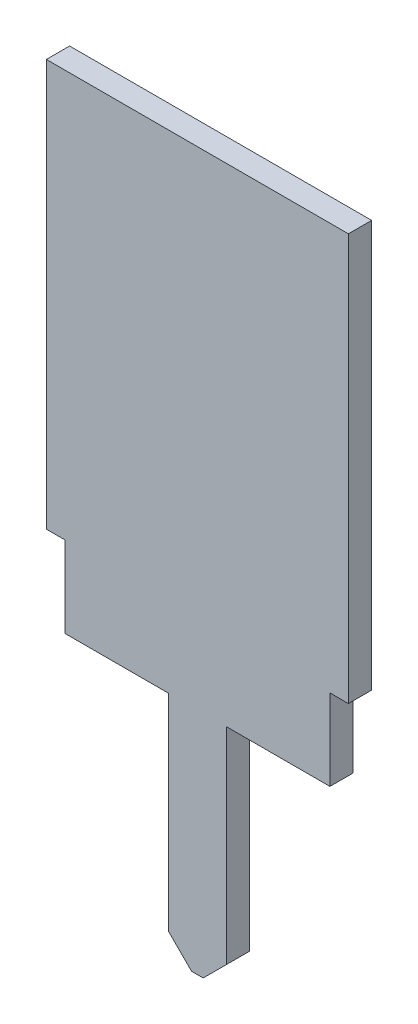
ISO-10303-21;
HEADER;
FILE_DESCRIPTION(('STEP AP214'),'2;1');
FILE_NAME('part.step','',(''),(''),'','','');
FILE_SCHEMA(('AUTOMOTIVE_DESIGN { 1 0 10303 214 1 1 1 1 }'));
ENDSEC;
DATA;
#1=APPLICATION_CONTEXT('core data for automotive mechanical design processes');
#2=APPLICATION_PROTOCOL_DEFINITION('international standard','automotive_design',2000,#1);
#3=PRODUCT_CONTEXT('',#1,'mechanical');
#4=PRODUCT('Part','Part','',(#3));
#5=PRODUCT_RELATED_PRODUCT_CATEGORY('part','',(#4));
#6=PRODUCT_DEFINITION_FORMATION('','',#4);
#7=PRODUCT_DEFINITION_CONTEXT('part definition',#1,'design');
#8=PRODUCT_DEFINITION('design','',#6,#7);
#9=PRODUCT_DEFINITION_SHAPE('','',#8);
#10=(LENGTH_UNIT() NAMED_UNIT(*) SI_UNIT(.MILLI.,.METRE.));
#11=(NAMED_UNIT(*) PLANE_ANGLE_UNIT() SI_UNIT($,.RADIAN.));
#12=(NAMED_UNIT(*) SI_UNIT($,.STERADIAN.) SOLID_ANGLE_UNIT());
#13=UNCERTAINTY_MEASURE_WITH_UNIT(LENGTH_MEASURE(1.E-05),#10,'distance_accuracy_value','');
#14=(GEOMETRIC_REPRESENTATION_CONTEXT(3) GLOBAL_UNCERTAINTY_ASSIGNED_CONTEXT((#13)) GLOBAL_UNIT_ASSIGNED_CONTEXT((#10,
#11,#12)) REPRESENTATION_CONTEXT('',''));
#15=CARTESIAN_POINT('',(0.,0.,0.));
#16=DIRECTION('',(0.,0.,1.));
#17=DIRECTION('',(1.,0.,0.));
#18=AXIS2_PLACEMENT_3D('',#15,#16,#17);
#19=CARTESIAN_POINT('',(1.65,0.,0.127));
#20=DIRECTION('',(0.,-1.,0.));
#21=DIRECTION('',(0.,0.,-1.));
#22=AXIS2_PLACEMENT_3D('',#19,#20,#21);
#23=PLANE('',#22);
#24=DIRECTION('',(-1.,0.,0.));
#25=VECTOR('',#24,1.);
#26=CARTESIAN_POINT('',(1.65,0.,-0.127));
#27=LINE('',#26,#25);
#28=CARTESIAN_POINT('',(1.65,0.,-0.127));
#29=VERTEX_POINT('',#28);
#30=CARTESIAN_POINT('',(-1.65,0.,-0.127));
#31=VERTEX_POINT('',#30);
#32=EDGE_CURVE('E10',#29,#31,#27,.T.);
#33=ORIENTED_EDGE('',*,*,#32,.T.);
#34=DIRECTION('',(0.,0.,-1.));
#35=VECTOR('',#34,1.);
#36=CARTESIAN_POINT('',(-1.65,0.,0.127));
#37=LINE('',#36,#35);
#38=CARTESIAN_POINT('',(-1.65,0.,0.127));
#39=VERTEX_POINT('',#38);
#40=EDGE_CURVE('E24',#39,#31,#37,.T.);
#41=ORIENTED_EDGE('',*,*,#40,.F.);
#42=DIRECTION('',(-1.,0.,0.));
#43=VECTOR('',#42,1.);
#44=CARTESIAN_POINT('',(1.65,0.,0.127));
#45=LINE('',#44,#43);
#46=CARTESIAN_POINT('',(1.65,0.,0.127));
#47=VERTEX_POINT('',#46);
#48=EDGE_CURVE('E295',#47,#39,#45,.T.);
#49=ORIENTED_EDGE('',*,*,#48,.F.);
#50=DIRECTION('',(0.,0.,-1.));
#51=VECTOR('',#50,1.);
#52=CARTESIAN_POINT('',(1.65,0.,0.127));
#53=LINE('',#52,#51);
#54=EDGE_CURVE('E291',#47,#29,#53,.T.);
#55=ORIENTED_EDGE('',*,*,#54,.T.);
#56=EDGE_LOOP('',(#33,#41,#49,#55));
#57=FACE_BOUND('',#56,.T.);
#58=ADVANCED_FACE('F16',(#57),#23,.F.);
#59=CARTESIAN_POINT('',(1.65,-4.445,0.127));
#60=DIRECTION('',(-1.,0.,0.));
#61=DIRECTION('',(0.,0.,1.));
#62=AXIS2_PLACEMENT_3D('',#59,#60,#61);
#63=PLANE('',#62);
#64=DIRECTION('',(0.,1.,0.));
#65=VECTOR('',#64,1.);
#66=CARTESIAN_POINT('',(1.65,-4.445,-0.127));
#67=LINE('',#66,#65);
#68=CARTESIAN_POINT('',(1.65,-4.445,-0.127));
#69=VERTEX_POINT('',#68);
#70=EDGE_CURVE('E286',#69,#29,#67,.T.);
#71=ORIENTED_EDGE('',*,*,#70,.T.);
#72=ORIENTED_EDGE('',*,*,#54,.F.);
#73=DIRECTION('',(0.,1.,0.));
#74=VECTOR('',#73,1.);
#75=CARTESIAN_POINT('',(1.65,-4.445,0.127));
#76=LINE('',#75,#74);
#77=CARTESIAN_POINT('',(1.65,-4.445,0.127));
#78=VERTEX_POINT('',#77);
#79=EDGE_CURVE('E281',#78,#47,#76,.T.);
#80=ORIENTED_EDGE('',*,*,#79,.F.);
#81=DIRECTION('',(0.,0.,-1.));
#82=VECTOR('',#81,1.);
#83=CARTESIAN_POINT('',(1.65,-4.445,0.127));
#84=LINE('',#83,#82);
#85=EDGE_CURVE('E277',#78,#69,#84,.T.);
#86=ORIENTED_EDGE('',*,*,#85,.T.);
#87=EDGE_LOOP('',(#71,#72,#80,#86));
#88=FACE_BOUND('',#87,.T.);
#89=ADVANCED_FACE('F308',(#88),#63,.F.);
#90=CARTESIAN_POINT('',(1.448,-4.445,0.127));
#91=DIRECTION('',(0.,1.,0.));
#92=DIRECTION('',(0.,0.,1.));
#93=AXIS2_PLACEMENT_3D('',#90,#91,#92);
#94=PLANE('',#93);
#95=DIRECTION('',(1.,0.,0.));
#96=VECTOR('',#95,1.);
#97=CARTESIAN_POINT('',(1.448,-4.445,-0.127));
#98=LINE('',#97,#96);
#99=CARTESIAN_POINT('',(1.448,-4.445,-0.127));
#100=VERTEX_POINT('',#99);
#101=EDGE_CURVE('E272',#100,#69,#98,.T.);
#102=ORIENTED_EDGE('',*,*,#101,.T.);
#103=ORIENTED_EDGE('',*,*,#85,.F.);
#104=DIRECTION('',(1.,0.,0.));
#105=VECTOR('',#104,1.);
#106=CARTESIAN_POINT('',(1.448,-4.445,0.127));
#107=LINE('',#106,#105);
#108=CARTESIAN_POINT('',(1.448,-4.445,0.127));
#109=VERTEX_POINT('',#108);
#110=EDGE_CURVE('E267',#109,#78,#107,.T.);
#111=ORIENTED_EDGE('',*,*,#110,.F.);
#112=DIRECTION('',(0.,0.,-1.));
#113=VECTOR('',#112,1.);
#114=CARTESIAN_POINT('',(1.448,-4.445,0.127));
#115=LINE('',#114,#113);
#116=EDGE_CURVE('E263',#109,#100,#115,.T.);
#117=ORIENTED_EDGE('',*,*,#116,.T.);
#118=EDGE_LOOP('',(#102,#103,#111,#117));
#119=FACE_BOUND('',#118,.T.);
#120=ADVANCED_FACE('F315',(#119),#94,.F.);
#121=CARTESIAN_POINT('',(1.448,-5.33,0.127));
#122=DIRECTION('',(-1.,0.,0.));
#123=DIRECTION('',(0.,0.,1.));
#124=AXIS2_PLACEMENT_3D('',#121,#122,#123);
#125=PLANE('',#124);
#126=DIRECTION('',(0.,1.,0.));
#127=VECTOR('',#126,1.);
#128=CARTESIAN_POINT('',(1.448,-5.33,-0.127));
#129=LINE('',#128,#127);
#130=CARTESIAN_POINT('',(1.448,-5.33,-0.127));
#131=VERTEX_POINT('',#130);
#132=EDGE_CURVE('E258',#131,#100,#129,.T.);
#133=ORIENTED_EDGE('',*,*,#132,.T.);
#134=ORIENTED_EDGE('',*,*,#116,.F.);
#135=DIRECTION('',(0.,1.,0.));
#136=VECTOR('',#135,1.);
#137=CARTESIAN_POINT('',(1.448,-5.33,0.127));
#138=LINE('',#137,#136);
#139=CARTESIAN_POINT('',(1.448,-5.33,0.127));
#140=VERTEX_POINT('',#139);
#141=EDGE_CURVE('E253',#140,#109,#138,.T.);
#142=ORIENTED_EDGE('',*,*,#141,.F.);
#143=DIRECTION('',(0.,0.,-1.));
#144=VECTOR('',#143,1.);
#145=CARTESIAN_POINT('',(1.448,-5.33,0.127));
#146=LINE('',#145,#144);
#147=EDGE_CURVE('E249',#140,#131,#146,.T.);
#148=ORIENTED_EDGE('',*,*,#147,.T.);
#149=EDGE_LOOP('',(#133,#134,#142,#148));
#150=FACE_BOUND('',#149,.T.);
#151=ADVANCED_FACE('F318',(#150),#125,.F.);
#152=CARTESIAN_POINT('',(0.3175,-5.33,0.127));
#153=DIRECTION('',(0.,1.,0.));
#154=DIRECTION('',(0.,0.,1.));
#155=AXIS2_PLACEMENT_3D('',#152,#153,#154);
#156=PLANE('',#155);
#157=DIRECTION('',(1.,0.,0.));
#158=VECTOR('',#157,1.);
#159=CARTESIAN_POINT('',(0.3175,-5.33,-0.127));
#160=LINE('',#159,#158);
#161=CARTESIAN_POINT('',(0.3175,-5.33,-0.127));
#162=VERTEX_POINT('',#161);
#163=EDGE_CURVE('E244',#162,#131,#160,.T.);
#164=ORIENTED_EDGE('',*,*,#163,.T.);
#165=ORIENTED_EDGE('',*,*,#147,.F.);
#166=DIRECTION('',(1.,0.,0.));
#167=VECTOR('',#166,1.);
#168=CARTESIAN_POINT('',(0.3175,-5.33,0.127));
#169=LINE('',#168,#167);
#170=CARTESIAN_POINT('',(0.3175,-5.33,0.127));
#171=VERTEX_POINT('',#170);
#172=EDGE_CURVE('E239',#171,#140,#169,.T.);
#173=ORIENTED_EDGE('',*,*,#172,.F.);
#174=DIRECTION('',(0.,0.,-1.));
#175=VECTOR('',#174,1.);
#176=CARTESIAN_POINT('',(0.3175,-5.33,0.127));
#177=LINE('',#176,#175);
#178=EDGE_CURVE('E235',#171,#162,#177,.T.);
#179=ORIENTED_EDGE('',*,*,#178,.T.);
#180=EDGE_LOOP('',(#164,#165,#173,#179));
#181=FACE_BOUND('',#180,.T.);
#182=ADVANCED_FACE('F321',(#181),#156,.F.);
#183=CARTESIAN_POINT('',(0.3175,-7.581,0.127));
#184=DIRECTION('',(-1.,0.,0.));
#185=DIRECTION('',(0.,0.,1.));
#186=AXIS2_PLACEMENT_3D('',#183,#184,#185);
#187=PLANE('',#186);
#188=DIRECTION('',(0.,1.,0.));
#189=VECTOR('',#188,1.);
#190=CARTESIAN_POINT('',(0.3175,-7.581,-0.127));
#191=LINE('',#190,#189);
#192=CARTESIAN_POINT('',(0.3175,-7.581,-0.127));
#193=VERTEX_POINT('',#192);
#194=EDGE_CURVE('E230',#193,#162,#191,.T.);
#195=ORIENTED_EDGE('',*,*,#194,.T.);
#196=ORIENTED_EDGE('',*,*,#178,.F.);
#197=DIRECTION('',(0.,1.,0.));
#198=VECTOR('',#197,1.);
#199=CARTESIAN_POINT('',(0.3175,-7.581,0.127));
#200=LINE('',#199,#198);
#201=CARTESIAN_POINT('',(0.3175,-7.581,0.127));
#202=VERTEX_POINT('',#201);
#203=EDGE_CURVE('E225',#202,#171,#200,.T.);
#204=ORIENTED_EDGE('',*,*,#203,.F.);
#205=DIRECTION('',(0.,0.,-1.));
#206=VECTOR('',#205,1.);
#207=CARTESIAN_POINT('',(0.3175,-7.581,0.127));
#208=LINE('',#207,#206);
#209=EDGE_CURVE('E221',#202,#193,#208,.T.);
#210=ORIENTED_EDGE('',*,*,#209,.T.);
#211=EDGE_LOOP('',(#195,#196,#204,#210));
#212=FACE_BOUND('',#211,.T.);
#213=ADVANCED_FACE('F327',(#212),#187,.F.);
#214=CARTESIAN_POINT('',(0.0635,-7.835,0.127));
#215=DIRECTION('',(-0.707106781186546,0.707106781186549,0.));
#216=DIRECTION('',(-0.707106781186549,-0.707106781186546,0.));
#217=AXIS2_PLACEMENT_3D('',#214,#215,#216);
#218=PLANE('',#217);
#219=DIRECTION('',(0.707106781186549,0.707106781186546,0.));
#220=VECTOR('',#219,1.);
#221=CARTESIAN_POINT('',(0.0635,-7.835,-0.127));
#222=LINE('',#221,#220);
#223=CARTESIAN_POINT('',(0.0635,-7.835,-0.127));
#224=VERTEX_POINT('',#223);
#225=EDGE_CURVE('E216',#224,#193,#222,.T.);
#226=ORIENTED_EDGE('',*,*,#225,.T.);
#227=ORIENTED_EDGE('',*,*,#209,.F.);
#228=DIRECTION('',(0.707106781186549,0.707106781186546,0.));
#229=VECTOR('',#228,1.);
#230=CARTESIAN_POINT('',(0.0635,-7.835,0.127));
#231=LINE('',#230,#229);
#232=CARTESIAN_POINT('',(0.0635,-7.835,0.127));
#233=VERTEX_POINT('',#232);
#234=EDGE_CURVE('E211',#233,#202,#231,.T.);
#235=ORIENTED_EDGE('',*,*,#234,.F.);
#236=DIRECTION('',(0.,0.,-1.));
#237=VECTOR('',#236,1.);
#238=CARTESIAN_POINT('',(0.0635,-7.835,0.127));
#239=LINE('',#238,#237);
#240=EDGE_CURVE('E207',#233,#224,#239,.T.);
#241=ORIENTED_EDGE('',*,*,#240,.T.);
#242=EDGE_LOOP('',(#226,#227,#235,#241));
#243=FACE_BOUND('',#242,.T.);
#244=ADVANCED_FACE('F330',(#243),#218,.F.);
#245=CARTESIAN_POINT('',(-0.0635,-7.835,0.127));
#246=DIRECTION('',(0.,1.,0.));
#247=DIRECTION('',(0.,0.,1.));
#248=AXIS2_PLACEMENT_3D('',#245,#246,#247);
#249=PLANE('',#248);
#250=DIRECTION('',(1.,0.,0.));
#251=VECTOR('',#250,1.);
#252=CARTESIAN_POINT('',(-0.0635,-7.835,-0.127));
#253=LINE('',#252,#251);
#254=CARTESIAN_POINT('',(-0.0635,-7.835,-0.127));
#255=VERTEX_POINT('',#254);
#256=EDGE_CURVE('E202',#255,#224,#253,.T.);
#257=ORIENTED_EDGE('',*,*,#256,.T.);
#258=ORIENTED_EDGE('',*,*,#240,.F.);
#259=DIRECTION('',(1.,0.,0.));
#260=VECTOR('',#259,1.);
#261=CARTESIAN_POINT('',(-0.0635,-7.835,0.127));
#262=LINE('',#261,#260);
#263=CARTESIAN_POINT('',(-0.0635,-7.835,0.127));
#264=VERTEX_POINT('',#263);
#265=EDGE_CURVE('E197',#264,#233,#262,.T.);
#266=ORIENTED_EDGE('',*,*,#265,.F.);
#267=DIRECTION('',(0.,0.,-1.));
#268=VECTOR('',#267,1.);
#269=CARTESIAN_POINT('',(-0.0635,-7.835,0.127));
#270=LINE('',#269,#268);
#271=EDGE_CURVE('E193',#264,#255,#270,.T.);
#272=ORIENTED_EDGE('',*,*,#271,.T.);
#273=EDGE_LOOP('',(#257,#258,#266,#272));
#274=FACE_BOUND('',#273,.T.);
#275=ADVANCED_FACE('F333',(#274),#249,.F.);
#276=CARTESIAN_POINT('',(-0.3175,-7.581,0.127));
#277=DIRECTION('',(0.707106781186546,0.707106781186549,0.));
#278=DIRECTION('',(-0.707106781186549,0.707106781186546,0.));
#279=AXIS2_PLACEMENT_3D('',#276,#277,#278);
#280=PLANE('',#279);
#281=DIRECTION('',(0.707106781186549,-0.707106781186546,0.));
#282=VECTOR('',#281,1.);
#283=CARTESIAN_POINT('',(-0.3175,-7.581,-0.127));
#284=LINE('',#283,#282);
#285=CARTESIAN_POINT('',(-0.3175,-7.581,-0.127));
#286=VERTEX_POINT('',#285);
#287=EDGE_CURVE('E188',#286,#255,#284,.T.);
#288=ORIENTED_EDGE('',*,*,#287,.T.);
#289=ORIENTED_EDGE('',*,*,#271,.F.);
#290=DIRECTION('',(0.707106781186549,-0.707106781186546,0.));
#291=VECTOR('',#290,1.);
#292=CARTESIAN_POINT('',(-0.3175,-7.581,0.127));
#293=LINE('',#292,#291);
#294=CARTESIAN_POINT('',(-0.3175,-7.581,0.127));
#295=VERTEX_POINT('',#294);
#296=EDGE_CURVE('E183',#295,#264,#293,.T.);
#297=ORIENTED_EDGE('',*,*,#296,.F.);
#298=DIRECTION('',(0.,0.,-1.));
#299=VECTOR('',#298,1.);
#300=CARTESIAN_POINT('',(-0.3175,-7.581,0.127));
#301=LINE('',#300,#299);
#302=EDGE_CURVE('E179',#295,#286,#301,.T.);
#303=ORIENTED_EDGE('',*,*,#302,.T.);
#304=EDGE_LOOP('',(#288,#289,#297,#303));
#305=FACE_BOUND('',#304,.T.);
#306=ADVANCED_FACE('F338',(#305),#280,.F.);
#307=CARTESIAN_POINT('',(-0.3175,-5.33,0.127));
#308=DIRECTION('',(1.,0.,0.));
#309=DIRECTION('',(0.,0.,-1.));
#310=AXIS2_PLACEMENT_3D('',#307,#308,#309);
#311=PLANE('',#310);
#312=DIRECTION('',(0.,-1.,0.));
#313=VECTOR('',#312,1.);
#314=CARTESIAN_POINT('',(-0.3175,-5.33,-0.127));
#315=LINE('',#314,#313);
#316=CARTESIAN_POINT('',(-0.3175,-5.33,-0.127));
#317=VERTEX_POINT('',#316);
#318=EDGE_CURVE('E174',#317,#286,#315,.T.);
#319=ORIENTED_EDGE('',*,*,#318,.T.);
#320=ORIENTED_EDGE('',*,*,#302,.F.);
#321=DIRECTION('',(0.,-1.,0.));
#322=VECTOR('',#321,1.);
#323=CARTESIAN_POINT('',(-0.3175,-5.33,0.127));
#324=LINE('',#323,#322);
#325=CARTESIAN_POINT('',(-0.3175,-5.33,0.127));
#326=VERTEX_POINT('',#325);
#327=EDGE_CURVE('E169',#326,#295,#324,.T.);
#328=ORIENTED_EDGE('',*,*,#327,.F.);
#329=DIRECTION('',(0.,0.,-1.));
#330=VECTOR('',#329,1.);
#331=CARTESIAN_POINT('',(-0.3175,-5.33,0.127));
#332=LINE('',#331,#330);
#333=EDGE_CURVE('E165',#326,#317,#332,.T.);
#334=ORIENTED_EDGE('',*,*,#333,.T.);
#335=EDGE_LOOP('',(#319,#320,#328,#334));
#336=FACE_BOUND('',#335,.T.);
#337=ADVANCED_FACE('F341',(#336),#311,.F.);
#338=CARTESIAN_POINT('',(-1.448,-5.33,0.127));
#339=DIRECTION('',(0.,1.,0.));
#340=DIRECTION('',(0.,0.,1.));
#341=AXIS2_PLACEMENT_3D('',#338,#339,#340);
#342=PLANE('',#341);
#343=DIRECTION('',(1.,0.,0.));
#344=VECTOR('',#343,1.);
#345=CARTESIAN_POINT('',(-1.448,-5.33,-0.127));
#346=LINE('',#345,#344);
#347=CARTESIAN_POINT('',(-1.448,-5.33,-0.127));
#348=VERTEX_POINT('',#347);
#349=EDGE_CURVE('E160',#348,#317,#346,.T.);
#350=ORIENTED_EDGE('',*,*,#349,.T.);
#351=ORIENTED_EDGE('',*,*,#333,.F.);
#352=DIRECTION('',(1.,0.,0.));
#353=VECTOR('',#352,1.);
#354=CARTESIAN_POINT('',(-1.448,-5.33,0.127));
#355=LINE('',#354,#353);
#356=CARTESIAN_POINT('',(-1.448,-5.33,0.127));
#357=VERTEX_POINT('',#356);
#358=EDGE_CURVE('E155',#357,#326,#355,.T.);
#359=ORIENTED_EDGE('',*,*,#358,.F.);
#360=DIRECTION('',(0.,0.,-1.));
#361=VECTOR('',#360,1.);
#362=CARTESIAN_POINT('',(-1.448,-5.33,0.127));
#363=LINE('',#362,#361);
#364=EDGE_CURVE('E151',#357,#348,#363,.T.);
#365=ORIENTED_EDGE('',*,*,#364,.T.);
#366=EDGE_LOOP('',(#350,#351,#359,#365));
#367=FACE_BOUND('',#366,.T.);
#368=ADVANCED_FACE('F344',(#367),#342,.F.);
#369=CARTESIAN_POINT('',(-1.448,-4.445,0.127));
#370=DIRECTION('',(1.,0.,0.));
#371=DIRECTION('',(0.,0.,-1.));
#372=AXIS2_PLACEMENT_3D('',#369,#370,#371);
#373=PLANE('',#372);
#374=DIRECTION('',(0.,-1.,0.));
#375=VECTOR('',#374,1.);
#376=CARTESIAN_POINT('',(-1.448,-4.445,-0.127));
#377=LINE('',#376,#375);
#378=CARTESIAN_POINT('',(-1.448,-4.445,-0.127));
#379=VERTEX_POINT('',#378);
#380=EDGE_CURVE('E133',#379,#348,#377,.T.);
#381=ORIENTED_EDGE('',*,*,#380,.T.);
#382=ORIENTED_EDGE('',*,*,#364,.F.);
#383=DIRECTION('',(0.,-1.,0.));
#384=VECTOR('',#383,1.);
#385=CARTESIAN_POINT('',(-1.448,-4.445,0.127));
#386=LINE('',#385,#384);
#387=CARTESIAN_POINT('',(-1.448,-4.445,0.127));
#388=VERTEX_POINT('',#387);
#389=EDGE_CURVE('E136',#388,#357,#386,.T.);
#390=ORIENTED_EDGE('',*,*,#389,.F.);
#391=DIRECTION('',(0.,0.,-1.));
#392=VECTOR('',#391,1.);
#393=CARTESIAN_POINT('',(-1.448,-4.445,0.127));
#394=LINE('',#393,#392);
#395=EDGE_CURVE('E134',#388,#379,#394,.T.);
#396=ORIENTED_EDGE('',*,*,#395,.T.);
#397=EDGE_LOOP('',(#381,#382,#390,#396));
#398=FACE_BOUND('',#397,.T.);
#399=ADVANCED_FACE('F347',(#398),#373,.F.);
#400=CARTESIAN_POINT('',(-1.65,-4.445,0.127));
#401=DIRECTION('',(0.,1.,0.));
#402=DIRECTION('',(0.,0.,1.));
#403=AXIS2_PLACEMENT_3D('',#400,#401,#402);
#404=PLANE('',#403);
#405=DIRECTION('',(1.,0.,0.));
#406=VECTOR('',#405,1.);
#407=CARTESIAN_POINT('',(-1.65,-4.445,-0.127));
#408=LINE('',#407,#406);
#409=CARTESIAN_POINT('',(-1.65,-4.445,-0.127));
#410=VERTEX_POINT('',#409);
#411=EDGE_CURVE('E117',#410,#379,#408,.T.);
#412=ORIENTED_EDGE('',*,*,#411,.T.);
#413=ORIENTED_EDGE('',*,*,#395,.F.);
#414=DIRECTION('',(1.,0.,0.));
#415=VECTOR('',#414,1.);
#416=CARTESIAN_POINT('',(-1.65,-4.445,0.127));
#417=LINE('',#416,#415);
#418=CARTESIAN_POINT('',(-1.65,-4.445,0.127));
#419=VERTEX_POINT('',#418);
#420=EDGE_CURVE('E120',#419,#388,#417,.T.);
#421=ORIENTED_EDGE('',*,*,#420,.F.);
#422=DIRECTION('',(0.,0.,-1.));
#423=VECTOR('',#422,1.);
#424=CARTESIAN_POINT('',(-1.65,-4.445,0.127));
#425=LINE('',#424,#423);
#426=EDGE_CURVE('E112',#419,#410,#425,.T.);
#427=ORIENTED_EDGE('',*,*,#426,.T.);
#428=EDGE_LOOP('',(#412,#413,#421,#427));
#429=FACE_BOUND('',#428,.T.);
#430=ADVANCED_FACE('F114',(#429),#404,.F.);
#431=CARTESIAN_POINT('',(-1.65,0.,0.127));
#432=DIRECTION('',(1.,0.,0.));
#433=DIRECTION('',(0.,0.,-1.));
#434=AXIS2_PLACEMENT_3D('',#431,#432,#433);
#435=PLANE('',#434);
#436=DIRECTION('',(0.,-1.,0.));
#437=VECTOR('',#436,1.);
#438=CARTESIAN_POINT('',(-1.65,0.,-0.127));
#439=LINE('',#438,#437);
#440=EDGE_CURVE('E123',#31,#410,#439,.T.);
#441=ORIENTED_EDGE('',*,*,#440,.T.);
#442=ORIENTED_EDGE('',*,*,#426,.F.);
#443=DIRECTION('',(0.,-1.,0.));
#444=VECTOR('',#443,1.);
#445=CARTESIAN_POINT('',(-1.65,0.,0.127));
#446=LINE('',#445,#444);
#447=EDGE_CURVE('E128',#39,#419,#446,.T.);
#448=ORIENTED_EDGE('',*,*,#447,.F.);
#449=ORIENTED_EDGE('',*,*,#40,.T.);
#450=EDGE_LOOP('',(#441,#442,#448,#449));
#451=FACE_BOUND('',#450,.T.);
#452=ADVANCED_FACE('F126',(#451),#435,.F.);
#453=CARTESIAN_POINT('',(0.,0.,0.127));
#454=DIRECTION('',(0.,0.,1.));
#455=DIRECTION('',(1.,0.,0.));
#456=AXIS2_PLACEMENT_3D('',#453,#454,#455);
#457=PLANE('',#456);
#458=ORIENTED_EDGE('',*,*,#447,.T.);
#459=ORIENTED_EDGE('',*,*,#420,.T.);
#460=ORIENTED_EDGE('',*,*,#389,.T.);
#461=ORIENTED_EDGE('',*,*,#358,.T.);
#462=ORIENTED_EDGE('',*,*,#327,.T.);
#463=ORIENTED_EDGE('',*,*,#296,.T.);
#464=ORIENTED_EDGE('',*,*,#265,.T.);
#465=ORIENTED_EDGE('',*,*,#234,.T.);
#466=ORIENTED_EDGE('',*,*,#203,.T.);
#467=ORIENTED_EDGE('',*,*,#172,.T.);
#468=ORIENTED_EDGE('',*,*,#141,.T.);
#469=ORIENTED_EDGE('',*,*,#110,.T.);
#470=ORIENTED_EDGE('',*,*,#79,.T.);
#471=ORIENTED_EDGE('',*,*,#48,.T.);
#472=EDGE_LOOP('',(#458,#459,#460,#461,#462,#463,#464,#465,#466,#467,#468,#469,#470,#471));
#473=FACE_BOUND('',#472,.T.);
#474=ADVANCED_FACE('F305',(#473),#457,.T.);
#475=CARTESIAN_POINT('',(0.,0.,-0.127));
#476=DIRECTION('',(0.,0.,1.));
#477=DIRECTION('',(1.,0.,0.));
#478=AXIS2_PLACEMENT_3D('',#475,#476,#477);
#479=PLANE('',#478);
#480=ORIENTED_EDGE('',*,*,#440,.F.);
#481=ORIENTED_EDGE('',*,*,#32,.F.);
#482=ORIENTED_EDGE('',*,*,#70,.F.);
#483=ORIENTED_EDGE('',*,*,#101,.F.);
#484=ORIENTED_EDGE('',*,*,#132,.F.);
#485=ORIENTED_EDGE('',*,*,#163,.F.);
#486=ORIENTED_EDGE('',*,*,#194,.F.);
#487=ORIENTED_EDGE('',*,*,#225,.F.);
#488=ORIENTED_EDGE('',*,*,#256,.F.);
#489=ORIENTED_EDGE('',*,*,#287,.F.);
#490=ORIENTED_EDGE('',*,*,#318,.F.);
#491=ORIENTED_EDGE('',*,*,#349,.F.);
#492=ORIENTED_EDGE('',*,*,#380,.F.);
#493=ORIENTED_EDGE('',*,*,#411,.F.);
#494=EDGE_LOOP('',(#480,#481,#482,#483,#484,#485,#486,#487,#488,#489,#490,#491,#492,#493));
#495=FACE_BOUND('',#494,.T.);
#496=ADVANCED_FACE('F130',(#495),#479,.F.);
#497=CLOSED_SHELL('',(#58,#89,#120,#151,#182,#213,#244,#275,#306,#337,#368,#399,#430,#452,#474,#496));
#498=MANIFOLD_SOLID_BREP('B1',#497);
#499=ADVANCED_BREP_SHAPE_REPRESENTATION('',(#18,#498),#14);
#500=SHAPE_DEFINITION_REPRESENTATION(#9,#499);
ENDSEC;
END-ISO-10303-21;
